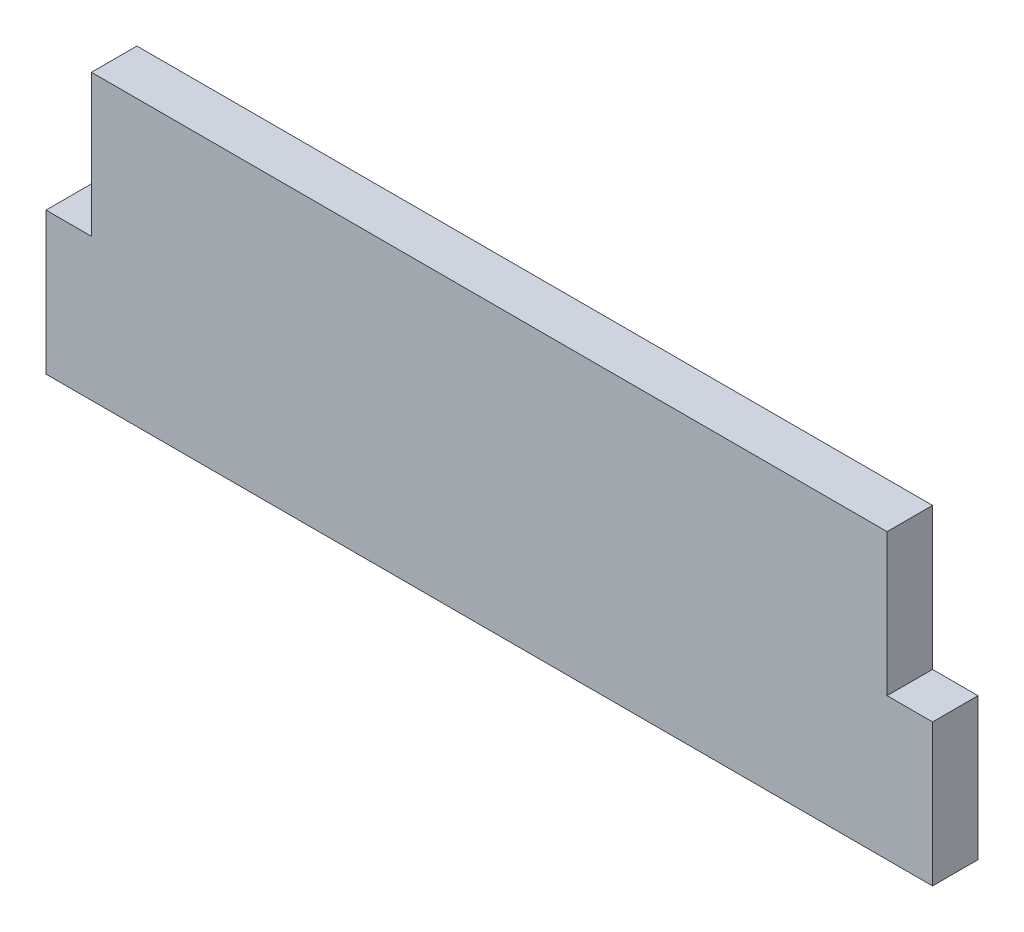
ISO-10303-21;
HEADER;
FILE_DESCRIPTION(('STEP AP214'),'2;1');
FILE_NAME('part.step','',(''),(''),'','','');
FILE_SCHEMA(('AUTOMOTIVE_DESIGN { 1 0 10303 214 1 1 1 1 }'));
ENDSEC;
DATA;
#1=APPLICATION_CONTEXT('core data for automotive mechanical design processes');
#2=APPLICATION_PROTOCOL_DEFINITION('international standard','automotive_design',2000,#1);
#3=PRODUCT_CONTEXT('',#1,'mechanical');
#4=PRODUCT('Part','Part','',(#3));
#5=PRODUCT_RELATED_PRODUCT_CATEGORY('part','',(#4));
#6=PRODUCT_DEFINITION_FORMATION('','',#4);
#7=PRODUCT_DEFINITION_CONTEXT('part definition',#1,'design');
#8=PRODUCT_DEFINITION('design','',#6,#7);
#9=PRODUCT_DEFINITION_SHAPE('','',#8);
#10=(LENGTH_UNIT() NAMED_UNIT(*) SI_UNIT(.MILLI.,.METRE.));
#11=(NAMED_UNIT(*) PLANE_ANGLE_UNIT() SI_UNIT($,.RADIAN.));
#12=(NAMED_UNIT(*) SI_UNIT($,.STERADIAN.) SOLID_ANGLE_UNIT());
#13=UNCERTAINTY_MEASURE_WITH_UNIT(LENGTH_MEASURE(1.E-05),#10,'distance_accuracy_value','');
#14=(GEOMETRIC_REPRESENTATION_CONTEXT(3) GLOBAL_UNCERTAINTY_ASSIGNED_CONTEXT((#13)) GLOBAL_UNIT_ASSIGNED_CONTEXT((#10,
#11,#12)) REPRESENTATION_CONTEXT('',''));
#15=CARTESIAN_POINT('',(0.,0.,0.));
#16=DIRECTION('',(0.,0.,1.));
#17=DIRECTION('',(1.,0.,0.));
#18=AXIS2_PLACEMENT_3D('',#15,#16,#17);
#19=CARTESIAN_POINT('',(0.,2.12493756973454E-13,5.08));
#20=DIRECTION('',(0.,-1.,0.));
#21=DIRECTION('',(1.,0.,0.));
#22=AXIS2_PLACEMENT_3D('',#19,#20,#21);
#23=PLANE('',#22);
#24=DIRECTION('',(-1.,0.,0.));
#25=VECTOR('',#24,1.);
#26=CARTESIAN_POINT('',(0.,2.12493756973454E-13,0.));
#27=LINE('',#26,#25);
#28=CARTESIAN_POINT('',(-44.45,0.,0.));
#29=VERTEX_POINT('',#28);
#30=CARTESIAN_POINT('',(-49.53,0.,0.));
#31=VERTEX_POINT('',#30);
#32=EDGE_CURVE('E130',#29,#31,#27,.T.);
#33=ORIENTED_EDGE('',*,*,#32,.T.);
#34=DIRECTION('',(0.,0.,-1.));
#35=VECTOR('',#34,1.);
#36=CARTESIAN_POINT('',(-49.53,0.,5.08));
#37=LINE('',#36,#35);
#38=CARTESIAN_POINT('',(-49.53,0.,5.08));
#39=VERTEX_POINT('',#38);
#40=EDGE_CURVE('E11',#39,#31,#37,.T.);
#41=ORIENTED_EDGE('',*,*,#40,.F.);
#42=DIRECTION('',(-1.,0.,0.));
#43=VECTOR('',#42,1.);
#44=CARTESIAN_POINT('',(0.,2.12493756973454E-13,5.08));
#45=LINE('',#44,#43);
#46=CARTESIAN_POINT('',(-44.45,0.,5.08));
#47=VERTEX_POINT('',#46);
#48=EDGE_CURVE('E150',#47,#39,#45,.T.);
#49=ORIENTED_EDGE('',*,*,#48,.F.);
#50=DIRECTION('',(0.,0.,-1.));
#51=VECTOR('',#50,1.);
#52=CARTESIAN_POINT('',(-44.45,0.,5.08));
#53=LINE('',#52,#51);
#54=EDGE_CURVE('E49',#47,#29,#53,.T.);
#55=ORIENTED_EDGE('',*,*,#54,.T.);
#56=EDGE_LOOP('',(#33,#41,#49,#55));
#57=FACE_BOUND('',#56,.T.);
#58=ADVANCED_FACE('F33',(#57),#23,.F.);
#59=CARTESIAN_POINT('',(-49.53,0.,5.08));
#60=DIRECTION('',(1.,0.,0.));
#61=DIRECTION('',(0.,0.,-1.));
#62=AXIS2_PLACEMENT_3D('',#59,#60,#61);
#63=PLANE('',#62);
#64=DIRECTION('',(0.,-1.,0.));
#65=VECTOR('',#64,1.);
#66=CARTESIAN_POINT('',(-49.53,0.,0.));
#67=LINE('',#66,#65);
#68=CARTESIAN_POINT('',(-49.53,-15.875,0.));
#69=VERTEX_POINT('',#68);
#70=EDGE_CURVE('E132',#31,#69,#67,.T.);
#71=ORIENTED_EDGE('',*,*,#70,.T.);
#72=DIRECTION('',(0.,0.,-1.));
#73=VECTOR('',#72,1.);
#74=CARTESIAN_POINT('',(-49.53,-15.875,5.08));
#75=LINE('',#74,#73);
#76=CARTESIAN_POINT('',(-49.53,-15.875,5.08));
#77=VERTEX_POINT('',#76);
#78=EDGE_CURVE('E41',#77,#69,#75,.T.);
#79=ORIENTED_EDGE('',*,*,#78,.F.);
#80=DIRECTION('',(0.,-1.,0.));
#81=VECTOR('',#80,1.);
#82=CARTESIAN_POINT('',(-49.53,0.,5.08));
#83=LINE('',#82,#81);
#84=EDGE_CURVE('E88',#39,#77,#83,.T.);
#85=ORIENTED_EDGE('',*,*,#84,.F.);
#86=ORIENTED_EDGE('',*,*,#40,.T.);
#87=EDGE_LOOP('',(#71,#79,#85,#86));
#88=FACE_BOUND('',#87,.T.);
#89=ADVANCED_FACE('F163',(#88),#63,.F.);
#90=CARTESIAN_POINT('',(0.,-15.8749999999998,5.08));
#91=DIRECTION('',(0.,-1.,0.));
#92=DIRECTION('',(1.,0.,0.));
#93=AXIS2_PLACEMENT_3D('',#90,#91,#92);
#94=PLANE('',#93);
#95=DIRECTION('',(-1.,0.,0.));
#96=VECTOR('',#95,1.);
#97=CARTESIAN_POINT('',(0.,-15.8749999999998,0.));
#98=LINE('',#97,#96);
#99=CARTESIAN_POINT('',(49.53,-15.875,0.));
#100=VERTEX_POINT('',#99);
#101=EDGE_CURVE('E135',#100,#69,#98,.T.);
#102=ORIENTED_EDGE('',*,*,#101,.F.);
#103=DIRECTION('',(0.,0.,-1.));
#104=VECTOR('',#103,1.);
#105=CARTESIAN_POINT('',(49.53,-15.875,5.08));
#106=LINE('',#105,#104);
#107=CARTESIAN_POINT('',(49.53,-15.875,5.08));
#108=VERTEX_POINT('',#107);
#109=EDGE_CURVE('E156',#108,#100,#106,.T.);
#110=ORIENTED_EDGE('',*,*,#109,.F.);
#111=DIRECTION('',(-1.,0.,0.));
#112=VECTOR('',#111,1.);
#113=CARTESIAN_POINT('',(0.,-15.8749999999998,5.08));
#114=LINE('',#113,#112);
#115=EDGE_CURVE('E162',#108,#77,#114,.T.);
#116=ORIENTED_EDGE('',*,*,#115,.T.);
#117=ORIENTED_EDGE('',*,*,#78,.T.);
#118=EDGE_LOOP('',(#102,#110,#116,#117));
#119=FACE_BOUND('',#118,.T.);
#120=ADVANCED_FACE('F160',(#119),#94,.T.);
#121=CARTESIAN_POINT('',(49.53,0.,5.08));
#122=DIRECTION('',(1.,0.,0.));
#123=DIRECTION('',(0.,0.,-1.));
#124=AXIS2_PLACEMENT_3D('',#121,#122,#123);
#125=PLANE('',#124);
#126=DIRECTION('',(0.,-1.,0.));
#127=VECTOR('',#126,1.);
#128=CARTESIAN_POINT('',(49.53,0.,0.));
#129=LINE('',#128,#127);
#130=CARTESIAN_POINT('',(49.53,0.,0.));
#131=VERTEX_POINT('',#130);
#132=EDGE_CURVE('E138',#131,#100,#129,.T.);
#133=ORIENTED_EDGE('',*,*,#132,.F.);
#134=DIRECTION('',(0.,0.,-1.));
#135=VECTOR('',#134,1.);
#136=CARTESIAN_POINT('',(49.53,0.,5.08));
#137=LINE('',#136,#135);
#138=CARTESIAN_POINT('',(49.53,0.,5.08));
#139=VERTEX_POINT('',#138);
#140=EDGE_CURVE('E154',#139,#131,#137,.T.);
#141=ORIENTED_EDGE('',*,*,#140,.F.);
#142=DIRECTION('',(0.,-1.,0.));
#143=VECTOR('',#142,1.);
#144=CARTESIAN_POINT('',(49.53,0.,5.08));
#145=LINE('',#144,#143);
#146=EDGE_CURVE('E172',#139,#108,#145,.T.);
#147=ORIENTED_EDGE('',*,*,#146,.T.);
#148=ORIENTED_EDGE('',*,*,#109,.T.);
#149=EDGE_LOOP('',(#133,#141,#147,#148));
#150=FACE_BOUND('',#149,.T.);
#151=ADVANCED_FACE('F170',(#150),#125,.T.);
#152=CARTESIAN_POINT('',(0.,0.,5.08));
#153=DIRECTION('',(0.,1.,0.));
#154=DIRECTION('',(-1.,0.,0.));
#155=AXIS2_PLACEMENT_3D('',#152,#153,#154);
#156=PLANE('',#155);
#157=DIRECTION('',(1.,0.,0.));
#158=VECTOR('',#157,1.);
#159=CARTESIAN_POINT('',(0.,0.,0.));
#160=LINE('',#159,#158);
#161=CARTESIAN_POINT('',(44.45,0.,0.));
#162=VERTEX_POINT('',#161);
#163=EDGE_CURVE('E141',#162,#131,#160,.T.);
#164=ORIENTED_EDGE('',*,*,#163,.F.);
#165=DIRECTION('',(0.,0.,-1.));
#166=VECTOR('',#165,1.);
#167=CARTESIAN_POINT('',(44.45,0.,5.08));
#168=LINE('',#167,#166);
#169=CARTESIAN_POINT('',(44.45,0.,5.08));
#170=VERTEX_POINT('',#169);
#171=EDGE_CURVE('E122',#170,#162,#168,.T.);
#172=ORIENTED_EDGE('',*,*,#171,.F.);
#173=DIRECTION('',(1.,0.,0.));
#174=VECTOR('',#173,1.);
#175=CARTESIAN_POINT('',(0.,0.,5.08));
#176=LINE('',#175,#174);
#177=EDGE_CURVE('E112',#170,#139,#176,.T.);
#178=ORIENTED_EDGE('',*,*,#177,.T.);
#179=ORIENTED_EDGE('',*,*,#140,.T.);
#180=EDGE_LOOP('',(#164,#172,#178,#179));
#181=FACE_BOUND('',#180,.T.);
#182=ADVANCED_FACE('F178',(#181),#156,.T.);
#183=CARTESIAN_POINT('',(44.45,0.,5.08));
#184=DIRECTION('',(-1.,0.,0.));
#185=DIRECTION('',(0.,0.,1.));
#186=AXIS2_PLACEMENT_3D('',#183,#184,#185);
#187=PLANE('',#186);
#188=DIRECTION('',(0.,1.,0.));
#189=VECTOR('',#188,1.);
#190=CARTESIAN_POINT('',(44.45,0.,0.));
#191=LINE('',#190,#189);
#192=CARTESIAN_POINT('',(44.45,15.875,0.));
#193=VERTEX_POINT('',#192);
#194=EDGE_CURVE('E119',#162,#193,#191,.T.);
#195=ORIENTED_EDGE('',*,*,#194,.T.);
#196=DIRECTION('',(0.,0.,-1.));
#197=VECTOR('',#196,1.);
#198=CARTESIAN_POINT('',(44.45,15.875,5.08));
#199=LINE('',#198,#197);
#200=CARTESIAN_POINT('',(44.45,15.875,5.08));
#201=VERTEX_POINT('',#200);
#202=EDGE_CURVE('E116',#201,#193,#199,.T.);
#203=ORIENTED_EDGE('',*,*,#202,.F.);
#204=DIRECTION('',(0.,1.,0.));
#205=VECTOR('',#204,1.);
#206=CARTESIAN_POINT('',(44.45,0.,5.08));
#207=LINE('',#206,#205);
#208=EDGE_CURVE('E104',#170,#201,#207,.T.);
#209=ORIENTED_EDGE('',*,*,#208,.F.);
#210=ORIENTED_EDGE('',*,*,#171,.T.);
#211=EDGE_LOOP('',(#195,#203,#209,#210));
#212=FACE_BOUND('',#211,.T.);
#213=ADVANCED_FACE('F117',(#212),#187,.F.);
#214=CARTESIAN_POINT('',(0.,15.875,5.08));
#215=DIRECTION('',(0.,-1.,0.));
#216=DIRECTION('',(1.,0.,0.));
#217=AXIS2_PLACEMENT_3D('',#214,#215,#216);
#218=PLANE('',#217);
#219=DIRECTION('',(-1.,0.,0.));
#220=VECTOR('',#219,1.);
#221=CARTESIAN_POINT('',(0.,15.875,0.));
#222=LINE('',#221,#220);
#223=CARTESIAN_POINT('',(-44.45,15.875,0.));
#224=VERTEX_POINT('',#223);
#225=EDGE_CURVE('E145',#193,#224,#222,.T.);
#226=ORIENTED_EDGE('',*,*,#225,.T.);
#227=DIRECTION('',(0.,0.,-1.));
#228=VECTOR('',#227,1.);
#229=CARTESIAN_POINT('',(-44.45,15.875,5.08));
#230=LINE('',#229,#228);
#231=CARTESIAN_POINT('',(-44.45,15.875,5.08));
#232=VERTEX_POINT('',#231);
#233=EDGE_CURVE('E76',#232,#224,#230,.T.);
#234=ORIENTED_EDGE('',*,*,#233,.F.);
#235=DIRECTION('',(-1.,0.,0.));
#236=VECTOR('',#235,1.);
#237=CARTESIAN_POINT('',(0.,15.875,5.08));
#238=LINE('',#237,#236);
#239=EDGE_CURVE('E109',#201,#232,#238,.T.);
#240=ORIENTED_EDGE('',*,*,#239,.F.);
#241=ORIENTED_EDGE('',*,*,#202,.T.);
#242=EDGE_LOOP('',(#226,#234,#240,#241));
#243=FACE_BOUND('',#242,.T.);
#244=ADVANCED_FACE('F124',(#243),#218,.F.);
#245=CARTESIAN_POINT('',(-44.45,0.,5.08));
#246=DIRECTION('',(-1.,0.,0.));
#247=DIRECTION('',(0.,0.,1.));
#248=AXIS2_PLACEMENT_3D('',#245,#246,#247);
#249=PLANE('',#248);
#250=DIRECTION('',(0.,1.,0.));
#251=VECTOR('',#250,1.);
#252=CARTESIAN_POINT('',(-44.45,0.,0.));
#253=LINE('',#252,#251);
#254=EDGE_CURVE('E147',#29,#224,#253,.T.);
#255=ORIENTED_EDGE('',*,*,#254,.F.);
#256=ORIENTED_EDGE('',*,*,#54,.F.);
#257=DIRECTION('',(0.,1.,0.));
#258=VECTOR('',#257,1.);
#259=CARTESIAN_POINT('',(-44.45,0.,5.08));
#260=LINE('',#259,#258);
#261=EDGE_CURVE('E125',#47,#232,#260,.T.);
#262=ORIENTED_EDGE('',*,*,#261,.T.);
#263=ORIENTED_EDGE('',*,*,#233,.T.);
#264=EDGE_LOOP('',(#255,#256,#262,#263));
#265=FACE_BOUND('',#264,.T.);
#266=ADVANCED_FACE('F179',(#265),#249,.T.);
#267=CARTESIAN_POINT('',(0.,0.,5.08));
#268=DIRECTION('',(0.,0.,1.));
#269=DIRECTION('',(1.,0.,0.));
#270=AXIS2_PLACEMENT_3D('',#267,#268,#269);
#271=PLANE('',#270);
#272=ORIENTED_EDGE('',*,*,#48,.T.);
#273=ORIENTED_EDGE('',*,*,#84,.T.);
#274=ORIENTED_EDGE('',*,*,#115,.F.);
#275=ORIENTED_EDGE('',*,*,#146,.F.);
#276=ORIENTED_EDGE('',*,*,#177,.F.);
#277=ORIENTED_EDGE('',*,*,#208,.T.);
#278=ORIENTED_EDGE('',*,*,#239,.T.);
#279=ORIENTED_EDGE('',*,*,#261,.F.);
#280=EDGE_LOOP('',(#272,#273,#274,#275,#276,#277,#278,#279));
#281=FACE_BOUND('',#280,.T.);
#282=ADVANCED_FACE('F106',(#281),#271,.T.);
#283=CARTESIAN_POINT('',(0.,0.,0.));
#284=DIRECTION('',(0.,0.,1.));
#285=DIRECTION('',(1.,0.,0.));
#286=AXIS2_PLACEMENT_3D('',#283,#284,#285);
#287=PLANE('',#286);
#288=ORIENTED_EDGE('',*,*,#32,.F.);
#289=ORIENTED_EDGE('',*,*,#254,.T.);
#290=ORIENTED_EDGE('',*,*,#225,.F.);
#291=ORIENTED_EDGE('',*,*,#194,.F.);
#292=ORIENTED_EDGE('',*,*,#163,.T.);
#293=ORIENTED_EDGE('',*,*,#132,.T.);
#294=ORIENTED_EDGE('',*,*,#101,.T.);
#295=ORIENTED_EDGE('',*,*,#70,.F.);
#296=EDGE_LOOP('',(#288,#289,#290,#291,#292,#293,#294,#295));
#297=FACE_BOUND('',#296,.T.);
#298=ADVANCED_FACE('F166',(#297),#287,.F.);
#299=CLOSED_SHELL('',(#58,#89,#120,#151,#182,#213,#244,#266,#282,#298));
#300=MANIFOLD_SOLID_BREP('B2',#299);
#301=ADVANCED_BREP_SHAPE_REPRESENTATION('',(#18,#300),#14);
#302=SHAPE_DEFINITION_REPRESENTATION(#9,#301);
ENDSEC;
END-ISO-10303-21;
